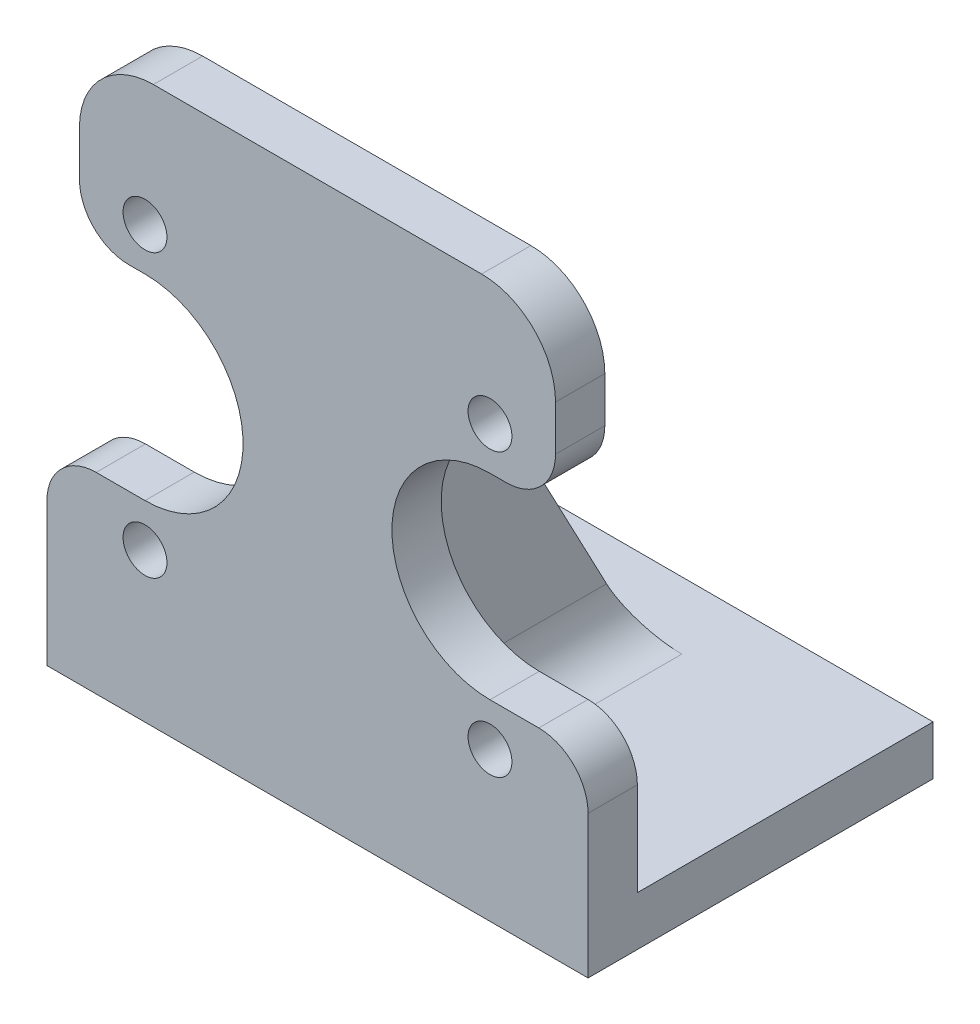
ISO-10303-21;
HEADER;
FILE_DESCRIPTION(('STEP AP214'),'2;1');
FILE_NAME('part.step','',(''),(''),'','','');
FILE_SCHEMA(('AUTOMOTIVE_DESIGN { 1 0 10303 214 1 1 1 1 }'));
ENDSEC;
DATA;
#1=APPLICATION_CONTEXT('core data for automotive mechanical design processes');
#2=APPLICATION_PROTOCOL_DEFINITION('international standard','automotive_design',2000,#1);
#3=PRODUCT_CONTEXT('',#1,'mechanical');
#4=PRODUCT('Part','Part','',(#3));
#5=PRODUCT_RELATED_PRODUCT_CATEGORY('part','',(#4));
#6=PRODUCT_DEFINITION_FORMATION('','',#4);
#7=PRODUCT_DEFINITION_CONTEXT('part definition',#1,'design');
#8=PRODUCT_DEFINITION('design','',#6,#7);
#9=PRODUCT_DEFINITION_SHAPE('','',#8);
#10=(LENGTH_UNIT() NAMED_UNIT(*) SI_UNIT(.MILLI.,.METRE.));
#11=(NAMED_UNIT(*) PLANE_ANGLE_UNIT() SI_UNIT($,.RADIAN.));
#12=(NAMED_UNIT(*) SI_UNIT($,.STERADIAN.) SOLID_ANGLE_UNIT());
#13=UNCERTAINTY_MEASURE_WITH_UNIT(LENGTH_MEASURE(1.E-05),#10,'distance_accuracy_value','');
#14=(GEOMETRIC_REPRESENTATION_CONTEXT(3) GLOBAL_UNCERTAINTY_ASSIGNED_CONTEXT((#13)) GLOBAL_UNIT_ASSIGNED_CONTEXT((#10,
#11,#12)) REPRESENTATION_CONTEXT('',''));
#15=CARTESIAN_POINT('',(0.,0.,0.));
#16=DIRECTION('',(0.,0.,1.));
#17=DIRECTION('',(1.,0.,0.));
#18=AXIS2_PLACEMENT_3D('',#15,#16,#17);
#19=CARTESIAN_POINT('',(47.5,20.,-10.));
#20=DIRECTION('',(0.,0.,-1.));
#21=DIRECTION('',(-1.,0.,0.));
#22=AXIS2_PLACEMENT_3D('',#19,#20,#21);
#23=CYLINDRICAL_SURFACE('',#22,10.);
#24=DIRECTION('',(0.,0.,-1.));
#25=VECTOR('',#24,1.);
#26=CARTESIAN_POINT('',(47.5,10.,-10.));
#27=LINE('',#26,#25);
#28=CARTESIAN_POINT('',(47.5,10.,-10.));
#29=VERTEX_POINT('',#28);
#30=CARTESIAN_POINT('',(47.5,10.,-56.4277157369135));
#31=VERTEX_POINT('',#30);
#32=EDGE_CURVE('E244',#29,#31,#27,.T.);
#33=ORIENTED_EDGE('',*,*,#32,.F.);
#34=CARTESIAN_POINT('',(47.5,20.,-10.));
#35=DIRECTION('',(0.,0.,1.));
#36=DIRECTION('',(1.,0.,0.));
#37=AXIS2_PLACEMENT_3D('',#34,#35,#36);
#38=CIRCLE('',#37,10.);
#39=CARTESIAN_POINT('',(57.5,20.,-10.));
#40=VERTEX_POINT('',#39);
#41=EDGE_CURVE('E39',#40,#29,#38,.F.);
#42=ORIENTED_EDGE('',*,*,#41,.F.);
#43=DIRECTION('',(0.,0.,-1.));
#44=VECTOR('',#43,1.);
#45=CARTESIAN_POINT('',(57.5,20.,0.));
#46=LINE('',#45,#44);
#47=CARTESIAN_POINT('',(57.5,20.,-51.1455211930621));
#48=VERTEX_POINT('',#47);
#49=EDGE_CURVE('E247',#48,#40,#46,.F.);
#50=ORIENTED_EDGE('',*,*,#49,.F.);
#51=CARTESIAN_POINT('',(47.5,20.,-51.1455211930621));
#52=DIRECTION('',(0.,-0.467064047912866,0.884223487104503));
#53=DIRECTION('',(0.,-0.884223487104504,-0.467064047912866));
#54=AXIS2_PLACEMENT_3D('',#51,#52,#53);
#55=ELLIPSE('',#54,11.3093580365595,10.);
#56=EDGE_CURVE('E11',#48,#31,#55,.F.);
#57=ORIENTED_EDGE('',*,*,#56,.T.);
#58=EDGE_LOOP('',(#33,#42,#50,#57));
#59=FACE_BOUND('',#58,.T.);
#60=ADVANCED_FACE('F32',(#59),#23,.F.);
#61=CARTESIAN_POINT('',(82.5,20.,-10.));
#62=DIRECTION('',(0.,0.,-1.));
#63=DIRECTION('',(-1.,0.,0.));
#64=AXIS2_PLACEMENT_3D('',#61,#62,#63);
#65=CYLINDRICAL_SURFACE('',#64,10.);
#66=DIRECTION('',(0.,0.,1.));
#67=VECTOR('',#66,1.);
#68=CARTESIAN_POINT('',(82.5,10.,-10.));
#69=LINE('',#68,#67);
#70=CARTESIAN_POINT('',(82.5,10.,-56.4277157369135));
#71=VERTEX_POINT('',#70);
#72=CARTESIAN_POINT('',(82.5,10.,-10.));
#73=VERTEX_POINT('',#72);
#74=EDGE_CURVE('E373',#71,#73,#69,.T.);
#75=ORIENTED_EDGE('',*,*,#74,.F.);
#76=CARTESIAN_POINT('',(82.5,20.,-51.1455211930621));
#77=DIRECTION('',(0.,-0.467064047912866,0.884223487104503));
#78=DIRECTION('',(0.,-0.884223487104504,-0.467064047912866));
#79=AXIS2_PLACEMENT_3D('',#76,#77,#78);
#80=ELLIPSE('',#79,11.3093580365595,10.);
#81=CARTESIAN_POINT('',(72.5,20.,-51.1455211930621));
#82=VERTEX_POINT('',#81);
#83=EDGE_CURVE('E242',#71,#82,#80,.F.);
#84=ORIENTED_EDGE('',*,*,#83,.T.);
#85=DIRECTION('',(0.,0.,1.));
#86=VECTOR('',#85,1.);
#87=CARTESIAN_POINT('',(72.5,20.,-10.));
#88=LINE('',#87,#86);
#89=CARTESIAN_POINT('',(72.5,20.,-10.));
#90=VERTEX_POINT('',#89);
#91=EDGE_CURVE('E469',#90,#82,#88,.F.);
#92=ORIENTED_EDGE('',*,*,#91,.F.);
#93=CARTESIAN_POINT('',(82.5,20.,-10.));
#94=DIRECTION('',(0.,0.,1.));
#95=DIRECTION('',(1.,0.,0.));
#96=AXIS2_PLACEMENT_3D('',#93,#94,#95);
#97=CIRCLE('',#96,10.);
#98=EDGE_CURVE('E472',#73,#90,#97,.F.);
#99=ORIENTED_EDGE('',*,*,#98,.F.);
#100=EDGE_LOOP('',(#75,#84,#92,#99));
#101=FACE_BOUND('',#100,.T.);
#102=ADVANCED_FACE('F477',(#101),#65,.F.);
#103=CARTESIAN_POINT('',(20.1,28.94,-10.));
#104=DIRECTION('',(0.,0.,1.));
#105=DIRECTION('',(1.,0.,0.));
#106=AXIS2_PLACEMENT_3D('',#103,#104,#105);
#107=CYLINDRICAL_SURFACE('',#106,9.99999999999999);
#108=CARTESIAN_POINT('',(20.1,28.94,0.));
#109=DIRECTION('',(0.,0.,1.));
#110=DIRECTION('',(1.,0.,0.));
#111=AXIS2_PLACEMENT_3D('',#108,#109,#110);
#112=CIRCLE('',#111,9.99999999999999);
#113=CARTESIAN_POINT('',(20.1,38.94,0.));
#114=VERTEX_POINT('',#113);
#115=CARTESIAN_POINT('',(10.1,28.94,0.));
#116=VERTEX_POINT('',#115);
#117=EDGE_CURVE('E320',#114,#116,#112,.T.);
#118=ORIENTED_EDGE('',*,*,#117,.F.);
#119=DIRECTION('',(0.,0.,1.));
#120=VECTOR('',#119,1.);
#121=CARTESIAN_POINT('',(20.1,38.94,-10.));
#122=LINE('',#121,#120);
#123=CARTESIAN_POINT('',(20.1,38.94,-10.));
#124=VERTEX_POINT('',#123);
#125=EDGE_CURVE('E371',#124,#114,#122,.T.);
#126=ORIENTED_EDGE('',*,*,#125,.F.);
#127=CARTESIAN_POINT('',(20.1,28.94,-10.));
#128=DIRECTION('',(0.,0.,1.));
#129=DIRECTION('',(1.,0.,0.));
#130=AXIS2_PLACEMENT_3D('',#127,#128,#129);
#131=CIRCLE('',#130,9.99999999999999);
#132=CARTESIAN_POINT('',(10.1,28.94,-10.));
#133=VERTEX_POINT('',#132);
#134=EDGE_CURVE('E267',#124,#133,#131,.T.);
#135=ORIENTED_EDGE('',*,*,#134,.T.);
#136=DIRECTION('',(0.,0.,1.));
#137=VECTOR('',#136,1.);
#138=CARTESIAN_POINT('',(10.1,28.94,-10.));
#139=LINE('',#138,#137);
#140=EDGE_CURVE('E263',#133,#116,#139,.T.);
#141=ORIENTED_EDGE('',*,*,#140,.T.);
#142=EDGE_LOOP('',(#118,#126,#135,#141));
#143=FACE_BOUND('',#142,.T.);
#144=ADVANCED_FACE('F403',(#143),#107,.T.);
#145=CARTESIAN_POINT('',(30.,38.94,-10.));
#146=DIRECTION('',(0.,1.,0.));
#147=DIRECTION('',(0.,0.,1.));
#148=AXIS2_PLACEMENT_3D('',#145,#146,#147);
#149=PLANE('',#148);
#150=DIRECTION('',(-1.,0.,0.));
#151=VECTOR('',#150,1.);
#152=CARTESIAN_POINT('',(30.,38.94,0.));
#153=LINE('',#152,#151);
#154=CARTESIAN_POINT('',(30.,38.94,0.));
#155=VERTEX_POINT('',#154);
#156=EDGE_CURVE('E270',#155,#114,#153,.T.);
#157=ORIENTED_EDGE('',*,*,#156,.F.);
#158=DIRECTION('',(0.,0.,1.));
#159=VECTOR('',#158,1.);
#160=CARTESIAN_POINT('',(30.,38.94,-10.));
#161=LINE('',#160,#159);
#162=CARTESIAN_POINT('',(30.,38.94,-10.));
#163=VERTEX_POINT('',#162);
#164=EDGE_CURVE('E374',#163,#155,#161,.T.);
#165=ORIENTED_EDGE('',*,*,#164,.F.);
#166=DIRECTION('',(-1.,0.,0.));
#167=VECTOR('',#166,1.);
#168=CARTESIAN_POINT('',(30.,38.94,-10.));
#169=LINE('',#168,#167);
#170=EDGE_CURVE('E317',#163,#124,#169,.T.);
#171=ORIENTED_EDGE('',*,*,#170,.T.);
#172=ORIENTED_EDGE('',*,*,#125,.T.);
#173=EDGE_LOOP('',(#157,#165,#171,#172));
#174=FACE_BOUND('',#173,.T.);
#175=ADVANCED_FACE('F409',(#174),#149,.T.);
#176=CARTESIAN_POINT('',(30.,58.84,-10.));
#177=DIRECTION('',(0.,0.,1.));
#178=DIRECTION('',(1.,0.,0.));
#179=AXIS2_PLACEMENT_3D('',#176,#177,#178);
#180=CYLINDRICAL_SURFACE('',#179,19.9);
#181=CARTESIAN_POINT('',(30.,58.84,0.));
#182=DIRECTION('',(0.,0.,-1.));
#183=DIRECTION('',(1.,0.,0.));
#184=AXIS2_PLACEMENT_3D('',#181,#182,#183);
#185=CIRCLE('',#184,19.9);
#186=CARTESIAN_POINT('',(30.,78.74,0.));
#187=VERTEX_POINT('',#186);
#188=EDGE_CURVE('E366',#187,#155,#185,.T.);
#189=ORIENTED_EDGE('',*,*,#188,.F.);
#190=DIRECTION('',(0.,0.,1.));
#191=VECTOR('',#190,1.);
#192=CARTESIAN_POINT('',(30.,78.74,-10.));
#193=LINE('',#192,#191);
#194=CARTESIAN_POINT('',(30.,78.74,-10.));
#195=VERTEX_POINT('',#194);
#196=EDGE_CURVE('E376',#195,#187,#193,.T.);
#197=ORIENTED_EDGE('',*,*,#196,.F.);
#198=CARTESIAN_POINT('',(30.,58.84,-10.));
#199=DIRECTION('',(0.,0.,-1.));
#200=DIRECTION('',(1.,0.,0.));
#201=AXIS2_PLACEMENT_3D('',#198,#199,#200);
#202=CIRCLE('',#201,19.9);
#203=EDGE_CURVE('E314',#195,#163,#202,.T.);
#204=ORIENTED_EDGE('',*,*,#203,.T.);
#205=ORIENTED_EDGE('',*,*,#164,.T.);
#206=EDGE_LOOP('',(#189,#197,#204,#205));
#207=FACE_BOUND('',#206,.T.);
#208=ADVANCED_FACE('F543',(#207),#180,.F.);
#209=CARTESIAN_POINT('',(26.7042467961392,78.74,-10.));
#210=DIRECTION('',(0.,-1.,0.));
#211=DIRECTION('',(0.,0.,-1.));
#212=AXIS2_PLACEMENT_3D('',#209,#210,#211);
#213=PLANE('',#212);
#214=DIRECTION('',(1.,0.,0.));
#215=VECTOR('',#214,1.);
#216=CARTESIAN_POINT('',(26.7042467961392,78.74,0.));
#217=LINE('',#216,#215);
#218=CARTESIAN_POINT('',(26.7042467961392,78.74,0.));
#219=VERTEX_POINT('',#218);
#220=EDGE_CURVE('E363',#219,#187,#217,.T.);
#221=ORIENTED_EDGE('',*,*,#220,.F.);
#222=DIRECTION('',(0.,0.,1.));
#223=VECTOR('',#222,1.);
#224=CARTESIAN_POINT('',(26.7042467961392,78.74,-10.));
#225=LINE('',#224,#223);
#226=CARTESIAN_POINT('',(26.7042467961392,78.74,-10.));
#227=VERTEX_POINT('',#226);
#228=EDGE_CURVE('E378',#227,#219,#225,.T.);
#229=ORIENTED_EDGE('',*,*,#228,.F.);
#230=DIRECTION('',(1.,0.,0.));
#231=VECTOR('',#230,1.);
#232=CARTESIAN_POINT('',(26.7042467961392,78.74,-10.));
#233=LINE('',#232,#231);
#234=EDGE_CURVE('E311',#227,#195,#233,.T.);
#235=ORIENTED_EDGE('',*,*,#234,.T.);
#236=ORIENTED_EDGE('',*,*,#196,.T.);
#237=EDGE_LOOP('',(#221,#229,#235,#236));
#238=FACE_BOUND('',#237,.T.);
#239=ADVANCED_FACE('F417',(#238),#213,.T.);
#240=CARTESIAN_POINT('',(26.7042467961392,88.74,-10.));
#241=DIRECTION('',(0.,0.,1.));
#242=DIRECTION('',(1.,0.,0.));
#243=AXIS2_PLACEMENT_3D('',#240,#241,#242);
#244=CYLINDRICAL_SURFACE('',#243,9.99999999999999);
#245=CARTESIAN_POINT('',(26.7042467961392,88.74,0.));
#246=DIRECTION('',(0.,0.,1.));
#247=DIRECTION('',(1.,0.,0.));
#248=AXIS2_PLACEMENT_3D('',#245,#246,#247);
#249=CIRCLE('',#248,9.99999999999999);
#250=CARTESIAN_POINT('',(16.7042467961392,88.74,0.));
#251=VERTEX_POINT('',#250);
#252=EDGE_CURVE('E360',#251,#219,#249,.T.);
#253=ORIENTED_EDGE('',*,*,#252,.F.);
#254=DIRECTION('',(0.,0.,1.));
#255=VECTOR('',#254,1.);
#256=CARTESIAN_POINT('',(16.7042467961392,88.74,-10.));
#257=LINE('',#256,#255);
#258=CARTESIAN_POINT('',(16.7042467961392,88.74,-10.));
#259=VERTEX_POINT('',#258);
#260=EDGE_CURVE('E380',#259,#251,#257,.T.);
#261=ORIENTED_EDGE('',*,*,#260,.F.);
#262=CARTESIAN_POINT('',(26.7042467961392,88.74,-10.));
#263=DIRECTION('',(0.,0.,1.));
#264=DIRECTION('',(1.,0.,0.));
#265=AXIS2_PLACEMENT_3D('',#262,#263,#264);
#266=CIRCLE('',#265,9.99999999999999);
#267=EDGE_CURVE('E308',#259,#227,#266,.T.);
#268=ORIENTED_EDGE('',*,*,#267,.T.);
#269=ORIENTED_EDGE('',*,*,#228,.T.);
#270=EDGE_LOOP('',(#253,#261,#268,#269));
#271=FACE_BOUND('',#270,.T.);
#272=ADVANCED_FACE('F420',(#271),#244,.T.);
#273=CARTESIAN_POINT('',(16.7042467961392,97.8947478202153,-10.));
#274=DIRECTION('',(-1.,0.,0.));
#275=DIRECTION('',(0.,0.,1.));
#276=AXIS2_PLACEMENT_3D('',#273,#274,#275);
#277=PLANE('',#276);
#278=DIRECTION('',(0.,-1.,0.));
#279=VECTOR('',#278,1.);
#280=CARTESIAN_POINT('',(16.7042467961392,97.8947478202153,0.));
#281=LINE('',#280,#279);
#282=CARTESIAN_POINT('',(16.7042467961392,97.8947478202153,0.));
#283=VERTEX_POINT('',#282);
#284=EDGE_CURVE('E357',#283,#251,#281,.T.);
#285=ORIENTED_EDGE('',*,*,#284,.F.);
#286=DIRECTION('',(0.,0.,1.));
#287=VECTOR('',#286,1.);
#288=CARTESIAN_POINT('',(16.7042467961392,97.8947478202153,-10.));
#289=LINE('',#288,#287);
#290=CARTESIAN_POINT('',(16.7042467961392,97.8947478202153,-10.));
#291=VERTEX_POINT('',#290);
#292=EDGE_CURVE('E382',#291,#283,#289,.T.);
#293=ORIENTED_EDGE('',*,*,#292,.F.);
#294=DIRECTION('',(0.,-1.,0.));
#295=VECTOR('',#294,1.);
#296=CARTESIAN_POINT('',(16.7042467961392,97.8947478202153,-10.));
#297=LINE('',#296,#295);
#298=EDGE_CURVE('E305',#291,#259,#297,.T.);
#299=ORIENTED_EDGE('',*,*,#298,.T.);
#300=ORIENTED_EDGE('',*,*,#260,.T.);
#301=EDGE_LOOP('',(#285,#293,#299,#300));
#302=FACE_BOUND('',#301,.T.);
#303=ADVANCED_FACE('F425',(#302),#277,.T.);
#304=CARTESIAN_POINT('',(31.7042467961392,97.8947478202153,-10.));
#305=DIRECTION('',(0.,0.,1.));
#306=DIRECTION('',(1.,0.,0.));
#307=AXIS2_PLACEMENT_3D('',#304,#305,#306);
#308=CYLINDRICAL_SURFACE('',#307,15.);
#309=CARTESIAN_POINT('',(31.7042467961392,97.8947478202153,0.));
#310=DIRECTION('',(0.,0.,1.));
#311=DIRECTION('',(1.,0.,0.));
#312=AXIS2_PLACEMENT_3D('',#309,#310,#311);
#313=CIRCLE('',#312,15.);
#314=CARTESIAN_POINT('',(31.7042467961392,112.894747820215,0.));
#315=VERTEX_POINT('',#314);
#316=EDGE_CURVE('E354',#315,#283,#313,.T.);
#317=ORIENTED_EDGE('',*,*,#316,.F.);
#318=DIRECTION('',(0.,0.,1.));
#319=VECTOR('',#318,1.);
#320=CARTESIAN_POINT('',(31.7042467961392,112.894747820215,-10.));
#321=LINE('',#320,#319);
#322=CARTESIAN_POINT('',(31.7042467961392,112.894747820215,-10.));
#323=VERTEX_POINT('',#322);
#324=EDGE_CURVE('E384',#323,#315,#321,.T.);
#325=ORIENTED_EDGE('',*,*,#324,.F.);
#326=CARTESIAN_POINT('',(31.7042467961392,97.8947478202153,-10.));
#327=DIRECTION('',(0.,0.,1.));
#328=DIRECTION('',(1.,0.,0.));
#329=AXIS2_PLACEMENT_3D('',#326,#327,#328);
#330=CIRCLE('',#329,15.);
#331=EDGE_CURVE('E302',#323,#291,#330,.T.);
#332=ORIENTED_EDGE('',*,*,#331,.T.);
#333=ORIENTED_EDGE('',*,*,#292,.T.);
#334=EDGE_LOOP('',(#317,#325,#332,#333));
#335=FACE_BOUND('',#334,.T.);
#336=ADVANCED_FACE('F428',(#335),#308,.T.);
#337=CARTESIAN_POINT('',(98.2957532038608,112.894747820215,-10.));
#338=DIRECTION('',(0.,1.,0.));
#339=DIRECTION('',(-1.,0.,0.));
#340=AXIS2_PLACEMENT_3D('',#337,#338,#339);
#341=PLANE('',#340);
#342=DIRECTION('',(-1.,0.,0.));
#343=VECTOR('',#342,1.);
#344=CARTESIAN_POINT('',(98.2957532038608,112.894747820215,0.));
#345=LINE('',#344,#343);
#346=CARTESIAN_POINT('',(98.2957532038608,112.894747820215,0.));
#347=VERTEX_POINT('',#346);
#348=EDGE_CURVE('E351',#347,#315,#345,.T.);
#349=ORIENTED_EDGE('',*,*,#348,.F.);
#350=DIRECTION('',(0.,0.,1.));
#351=VECTOR('',#350,1.);
#352=CARTESIAN_POINT('',(98.2957532038608,112.894747820215,-10.));
#353=LINE('',#352,#351);
#354=CARTESIAN_POINT('',(98.2957532038608,112.894747820215,-10.));
#355=VERTEX_POINT('',#354);
#356=EDGE_CURVE('E386',#355,#347,#353,.T.);
#357=ORIENTED_EDGE('',*,*,#356,.F.);
#358=DIRECTION('',(-1.,0.,0.));
#359=VECTOR('',#358,1.);
#360=CARTESIAN_POINT('',(98.2957532038608,112.894747820215,-10.));
#361=LINE('',#360,#359);
#362=EDGE_CURVE('E299',#355,#323,#361,.T.);
#363=ORIENTED_EDGE('',*,*,#362,.T.);
#364=ORIENTED_EDGE('',*,*,#324,.T.);
#365=EDGE_LOOP('',(#349,#357,#363,#364));
#366=FACE_BOUND('',#365,.T.);
#367=ADVANCED_FACE('F433',(#366),#341,.T.);
#368=CARTESIAN_POINT('',(98.2957532038608,97.8947478202153,-10.));
#369=DIRECTION('',(0.,0.,1.));
#370=DIRECTION('',(1.,0.,0.));
#371=AXIS2_PLACEMENT_3D('',#368,#369,#370);
#372=CYLINDRICAL_SURFACE('',#371,15.);
#373=CARTESIAN_POINT('',(98.2957532038608,97.8947478202153,0.));
#374=DIRECTION('',(0.,0.,1.));
#375=DIRECTION('',(-1.,0.,0.));
#376=AXIS2_PLACEMENT_3D('',#373,#374,#375);
#377=CIRCLE('',#376,15.);
#378=CARTESIAN_POINT('',(113.295753203861,97.8947478202153,0.));
#379=VERTEX_POINT('',#378);
#380=EDGE_CURVE('E348',#379,#347,#377,.T.);
#381=ORIENTED_EDGE('',*,*,#380,.F.);
#382=DIRECTION('',(0.,0.,1.));
#383=VECTOR('',#382,1.);
#384=CARTESIAN_POINT('',(113.295753203861,97.8947478202153,-10.));
#385=LINE('',#384,#383);
#386=CARTESIAN_POINT('',(113.295753203861,97.8947478202153,-10.));
#387=VERTEX_POINT('',#386);
#388=EDGE_CURVE('E388',#387,#379,#385,.T.);
#389=ORIENTED_EDGE('',*,*,#388,.F.);
#390=CARTESIAN_POINT('',(98.2957532038608,97.8947478202153,-10.));
#391=DIRECTION('',(0.,0.,1.));
#392=DIRECTION('',(-1.,0.,0.));
#393=AXIS2_PLACEMENT_3D('',#390,#391,#392);
#394=CIRCLE('',#393,15.);
#395=EDGE_CURVE('E296',#387,#355,#394,.T.);
#396=ORIENTED_EDGE('',*,*,#395,.T.);
#397=ORIENTED_EDGE('',*,*,#356,.T.);
#398=EDGE_LOOP('',(#381,#389,#396,#397));
#399=FACE_BOUND('',#398,.T.);
#400=ADVANCED_FACE('F436',(#399),#372,.T.);
#401=CARTESIAN_POINT('',(113.295753203861,97.8947478202153,-10.));
#402=DIRECTION('',(1.,0.,0.));
#403=DIRECTION('',(0.,0.,-1.));
#404=AXIS2_PLACEMENT_3D('',#401,#402,#403);
#405=PLANE('',#404);
#406=DIRECTION('',(0.,1.,0.));
#407=VECTOR('',#406,1.);
#408=CARTESIAN_POINT('',(113.295753203861,97.8947478202153,0.));
#409=LINE('',#408,#407);
#410=CARTESIAN_POINT('',(113.295753203861,88.74,0.));
#411=VERTEX_POINT('',#410);
#412=EDGE_CURVE('E345',#411,#379,#409,.T.);
#413=ORIENTED_EDGE('',*,*,#412,.F.);
#414=DIRECTION('',(0.,0.,1.));
#415=VECTOR('',#414,1.);
#416=CARTESIAN_POINT('',(113.295753203861,88.74,-10.));
#417=LINE('',#416,#415);
#418=CARTESIAN_POINT('',(113.295753203861,88.74,-10.));
#419=VERTEX_POINT('',#418);
#420=EDGE_CURVE('E390',#419,#411,#417,.T.);
#421=ORIENTED_EDGE('',*,*,#420,.F.);
#422=DIRECTION('',(0.,1.,0.));
#423=VECTOR('',#422,1.);
#424=CARTESIAN_POINT('',(113.295753203861,97.8947478202153,-10.));
#425=LINE('',#424,#423);
#426=EDGE_CURVE('E293',#419,#387,#425,.T.);
#427=ORIENTED_EDGE('',*,*,#426,.T.);
#428=ORIENTED_EDGE('',*,*,#388,.T.);
#429=EDGE_LOOP('',(#413,#421,#427,#428));
#430=FACE_BOUND('',#429,.T.);
#431=ADVANCED_FACE('F441',(#430),#405,.T.);
#432=CARTESIAN_POINT('',(103.295753203861,88.74,-10.));
#433=DIRECTION('',(0.,0.,1.));
#434=DIRECTION('',(1.,0.,0.));
#435=AXIS2_PLACEMENT_3D('',#432,#433,#434);
#436=CYLINDRICAL_SURFACE('',#435,10.);
#437=CARTESIAN_POINT('',(103.295753203861,88.74,0.));
#438=DIRECTION('',(0.,0.,1.));
#439=DIRECTION('',(-1.,0.,0.));
#440=AXIS2_PLACEMENT_3D('',#437,#438,#439);
#441=CIRCLE('',#440,10.);
#442=CARTESIAN_POINT('',(103.295753203861,78.74,0.));
#443=VERTEX_POINT('',#442);
#444=EDGE_CURVE('E342',#443,#411,#441,.T.);
#445=ORIENTED_EDGE('',*,*,#444,.F.);
#446=DIRECTION('',(0.,0.,1.));
#447=VECTOR('',#446,1.);
#448=CARTESIAN_POINT('',(103.295753203861,78.74,-10.));
#449=LINE('',#448,#447);
#450=CARTESIAN_POINT('',(103.295753203861,78.74,-10.));
#451=VERTEX_POINT('',#450);
#452=EDGE_CURVE('E392',#451,#443,#449,.T.);
#453=ORIENTED_EDGE('',*,*,#452,.F.);
#454=CARTESIAN_POINT('',(103.295753203861,88.74,-10.));
#455=DIRECTION('',(0.,0.,1.));
#456=DIRECTION('',(-1.,0.,0.));
#457=AXIS2_PLACEMENT_3D('',#454,#455,#456);
#458=CIRCLE('',#457,10.);
#459=EDGE_CURVE('E290',#451,#419,#458,.T.);
#460=ORIENTED_EDGE('',*,*,#459,.T.);
#461=ORIENTED_EDGE('',*,*,#420,.T.);
#462=EDGE_LOOP('',(#445,#453,#460,#461));
#463=FACE_BOUND('',#462,.T.);
#464=ADVANCED_FACE('F444',(#463),#436,.T.);
#465=CARTESIAN_POINT('',(103.295753203861,78.74,-10.));
#466=DIRECTION('',(0.,-1.,0.));
#467=DIRECTION('',(0.,0.,-1.));
#468=AXIS2_PLACEMENT_3D('',#465,#466,#467);
#469=PLANE('',#468);
#470=DIRECTION('',(1.,0.,0.));
#471=VECTOR('',#470,1.);
#472=CARTESIAN_POINT('',(103.295753203861,78.74,0.));
#473=LINE('',#472,#471);
#474=CARTESIAN_POINT('',(100.,78.74,0.));
#475=VERTEX_POINT('',#474);
#476=EDGE_CURVE('E339',#475,#443,#473,.T.);
#477=ORIENTED_EDGE('',*,*,#476,.F.);
#478=DIRECTION('',(0.,0.,1.));
#479=VECTOR('',#478,1.);
#480=CARTESIAN_POINT('',(100.,78.74,-10.));
#481=LINE('',#480,#479);
#482=CARTESIAN_POINT('',(100.,78.74,-10.));
#483=VERTEX_POINT('',#482);
#484=EDGE_CURVE('E394',#483,#475,#481,.T.);
#485=ORIENTED_EDGE('',*,*,#484,.F.);
#486=DIRECTION('',(1.,0.,0.));
#487=VECTOR('',#486,1.);
#488=CARTESIAN_POINT('',(103.295753203861,78.74,-10.));
#489=LINE('',#488,#487);
#490=EDGE_CURVE('E287',#483,#451,#489,.T.);
#491=ORIENTED_EDGE('',*,*,#490,.T.);
#492=ORIENTED_EDGE('',*,*,#452,.T.);
#493=EDGE_LOOP('',(#477,#485,#491,#492));
#494=FACE_BOUND('',#493,.T.);
#495=ADVANCED_FACE('F449',(#494),#469,.T.);
#496=CARTESIAN_POINT('',(100.,58.84,-10.));
#497=DIRECTION('',(0.,0.,1.));
#498=DIRECTION('',(1.,0.,0.));
#499=AXIS2_PLACEMENT_3D('',#496,#497,#498);
#500=CYLINDRICAL_SURFACE('',#499,19.9);
#501=CARTESIAN_POINT('',(100.,58.84,0.));
#502=DIRECTION('',(0.,0.,-1.));
#503=DIRECTION('',(-1.,0.,0.));
#504=AXIS2_PLACEMENT_3D('',#501,#502,#503);
#505=CIRCLE('',#504,19.9);
#506=CARTESIAN_POINT('',(100.,38.94,0.));
#507=VERTEX_POINT('',#506);
#508=EDGE_CURVE('E336',#507,#475,#505,.T.);
#509=ORIENTED_EDGE('',*,*,#508,.F.);
#510=DIRECTION('',(0.,0.,1.));
#511=VECTOR('',#510,1.);
#512=CARTESIAN_POINT('',(100.,38.94,-10.));
#513=LINE('',#512,#511);
#514=CARTESIAN_POINT('',(100.,38.94,-10.));
#515=VERTEX_POINT('',#514);
#516=EDGE_CURVE('E396',#515,#507,#513,.T.);
#517=ORIENTED_EDGE('',*,*,#516,.F.);
#518=CARTESIAN_POINT('',(100.,58.84,-10.));
#519=DIRECTION('',(0.,0.,-1.));
#520=DIRECTION('',(-1.,0.,0.));
#521=AXIS2_PLACEMENT_3D('',#518,#519,#520);
#522=CIRCLE('',#521,19.9);
#523=EDGE_CURVE('E284',#515,#483,#522,.T.);
#524=ORIENTED_EDGE('',*,*,#523,.T.);
#525=ORIENTED_EDGE('',*,*,#484,.T.);
#526=EDGE_LOOP('',(#509,#517,#524,#525));
#527=FACE_BOUND('',#526,.T.);
#528=ADVANCED_FACE('F452',(#527),#500,.F.);
#529=CARTESIAN_POINT('',(100.,38.94,-10.));
#530=DIRECTION('',(0.,1.,0.));
#531=DIRECTION('',(-1.,0.,0.));
#532=AXIS2_PLACEMENT_3D('',#529,#530,#531);
#533=PLANE('',#532);
#534=DIRECTION('',(-1.,0.,0.));
#535=VECTOR('',#534,1.);
#536=CARTESIAN_POINT('',(100.,38.94,0.));
#537=LINE('',#536,#535);
#538=CARTESIAN_POINT('',(109.9,38.94,0.));
#539=VERTEX_POINT('',#538);
#540=EDGE_CURVE('E333',#539,#507,#537,.T.);
#541=ORIENTED_EDGE('',*,*,#540,.F.);
#542=DIRECTION('',(0.,0.,1.));
#543=VECTOR('',#542,1.);
#544=CARTESIAN_POINT('',(109.9,38.94,-10.));
#545=LINE('',#544,#543);
#546=CARTESIAN_POINT('',(109.9,38.94,-10.));
#547=VERTEX_POINT('',#546);
#548=EDGE_CURVE('E398',#547,#539,#545,.T.);
#549=ORIENTED_EDGE('',*,*,#548,.F.);
#550=DIRECTION('',(-1.,0.,0.));
#551=VECTOR('',#550,1.);
#552=CARTESIAN_POINT('',(100.,38.94,-10.));
#553=LINE('',#552,#551);
#554=EDGE_CURVE('E281',#547,#515,#553,.T.);
#555=ORIENTED_EDGE('',*,*,#554,.T.);
#556=ORIENTED_EDGE('',*,*,#516,.T.);
#557=EDGE_LOOP('',(#541,#549,#555,#556));
#558=FACE_BOUND('',#557,.T.);
#559=ADVANCED_FACE('F457',(#558),#533,.T.);
#560=CARTESIAN_POINT('',(109.9,28.94,-10.));
#561=DIRECTION('',(0.,0.,1.));
#562=DIRECTION('',(1.,0.,0.));
#563=AXIS2_PLACEMENT_3D('',#560,#561,#562);
#564=CYLINDRICAL_SURFACE('',#563,10.);
#565=CARTESIAN_POINT('',(109.9,28.94,0.));
#566=DIRECTION('',(0.,0.,1.));
#567=DIRECTION('',(-1.,0.,0.));
#568=AXIS2_PLACEMENT_3D('',#565,#566,#567);
#569=CIRCLE('',#568,10.);
#570=CARTESIAN_POINT('',(119.9,28.94,0.));
#571=VERTEX_POINT('',#570);
#572=EDGE_CURVE('E330',#571,#539,#569,.T.);
#573=ORIENTED_EDGE('',*,*,#572,.F.);
#574=DIRECTION('',(0.,0.,1.));
#575=VECTOR('',#574,1.);
#576=CARTESIAN_POINT('',(119.9,28.94,-10.));
#577=LINE('',#576,#575);
#578=CARTESIAN_POINT('',(119.9,28.94,-10.));
#579=VERTEX_POINT('',#578);
#580=EDGE_CURVE('E205',#579,#571,#577,.T.);
#581=ORIENTED_EDGE('',*,*,#580,.F.);
#582=CARTESIAN_POINT('',(109.9,28.94,-10.));
#583=DIRECTION('',(0.,0.,1.));
#584=DIRECTION('',(-1.,0.,0.));
#585=AXIS2_PLACEMENT_3D('',#582,#583,#584);
#586=CIRCLE('',#585,10.);
#587=EDGE_CURVE('E268',#579,#547,#586,.T.);
#588=ORIENTED_EDGE('',*,*,#587,.T.);
#589=ORIENTED_EDGE('',*,*,#548,.T.);
#590=EDGE_LOOP('',(#573,#581,#588,#589));
#591=FACE_BOUND('',#590,.T.);
#592=ADVANCED_FACE('F460',(#591),#564,.T.);
#593=CARTESIAN_POINT('',(119.9,28.94,-10.));
#594=DIRECTION('',(1.,0.,0.));
#595=DIRECTION('',(0.,1.,0.));
#596=AXIS2_PLACEMENT_3D('',#593,#594,#595);
#597=PLANE('',#596);
#598=DIRECTION('',(0.,1.,0.));
#599=VECTOR('',#598,1.);
#600=CARTESIAN_POINT('',(119.9,28.94,0.));
#601=LINE('',#600,#599);
#602=CARTESIAN_POINT('',(119.9,0.,0.));
#603=VERTEX_POINT('',#602);
#604=EDGE_CURVE('E202',#603,#571,#601,.T.);
#605=ORIENTED_EDGE('',*,*,#604,.F.);
#606=DIRECTION('',(0.,0.,1.));
#607=VECTOR('',#606,1.);
#608=CARTESIAN_POINT('',(119.9,0.,-10.));
#609=LINE('',#608,#607);
#610=CARTESIAN_POINT('',(119.9,0.,-70.));
#611=VERTEX_POINT('',#610);
#612=EDGE_CURVE('E195',#611,#603,#609,.T.);
#613=ORIENTED_EDGE('',*,*,#612,.F.);
#614=DIRECTION('',(0.,1.,0.));
#615=VECTOR('',#614,1.);
#616=CARTESIAN_POINT('',(119.9,0.,-70.));
#617=LINE('',#616,#615);
#618=CARTESIAN_POINT('',(119.9,10.,-70.));
#619=VERTEX_POINT('',#618);
#620=EDGE_CURVE('E199',#611,#619,#617,.T.);
#621=ORIENTED_EDGE('',*,*,#620,.T.);
#622=DIRECTION('',(0.,0.,1.));
#623=VECTOR('',#622,1.);
#624=CARTESIAN_POINT('',(119.9,10.,-10.));
#625=LINE('',#624,#623);
#626=CARTESIAN_POINT('',(119.9,10.,-10.));
#627=VERTEX_POINT('',#626);
#628=EDGE_CURVE('E220',#619,#627,#625,.T.);
#629=ORIENTED_EDGE('',*,*,#628,.T.);
#630=DIRECTION('',(0.,1.,0.));
#631=VECTOR('',#630,1.);
#632=CARTESIAN_POINT('',(119.9,28.94,-10.));
#633=LINE('',#632,#631);
#634=EDGE_CURVE('E266',#627,#579,#633,.T.);
#635=ORIENTED_EDGE('',*,*,#634,.T.);
#636=ORIENTED_EDGE('',*,*,#580,.T.);
#637=EDGE_LOOP('',(#605,#613,#621,#629,#635,#636));
#638=FACE_BOUND('',#637,.T.);
#639=ADVANCED_FACE('F197',(#638),#597,.T.);
#640=CARTESIAN_POINT('',(62.0299521746018,0.,-10.));
#641=DIRECTION('',(0.,-1.,0.));
#642=DIRECTION('',(1.,0.,0.));
#643=AXIS2_PLACEMENT_3D('',#640,#641,#642);
#644=PLANE('',#643);
#645=DIRECTION('',(1.,0.,0.));
#646=VECTOR('',#645,1.);
#647=CARTESIAN_POINT('',(62.0299521746018,0.,0.));
#648=LINE('',#647,#646);
#649=CARTESIAN_POINT('',(10.1,0.,0.));
#650=VERTEX_POINT('',#649);
#651=EDGE_CURVE('E327',#650,#603,#648,.T.);
#652=ORIENTED_EDGE('',*,*,#651,.F.);
#653=DIRECTION('',(0.,0.,1.));
#654=VECTOR('',#653,1.);
#655=CARTESIAN_POINT('',(10.1,0.,-10.));
#656=LINE('',#655,#654);
#657=CARTESIAN_POINT('',(10.1,0.,-70.));
#658=VERTEX_POINT('',#657);
#659=EDGE_CURVE('E206',#658,#650,#656,.T.);
#660=ORIENTED_EDGE('',*,*,#659,.F.);
#661=DIRECTION('',(-1.,0.,0.));
#662=VECTOR('',#661,1.);
#663=CARTESIAN_POINT('',(119.9,0.,-70.));
#664=LINE('',#663,#662);
#665=EDGE_CURVE('E209',#611,#658,#664,.T.);
#666=ORIENTED_EDGE('',*,*,#665,.F.);
#667=ORIENTED_EDGE('',*,*,#612,.T.);
#668=EDGE_LOOP('',(#652,#660,#666,#667));
#669=FACE_BOUND('',#668,.T.);
#670=ADVANCED_FACE('F210',(#669),#644,.T.);
#671=CARTESIAN_POINT('',(10.1,28.94,-10.));
#672=DIRECTION('',(-1.,0.,0.));
#673=DIRECTION('',(0.,-1.,0.));
#674=AXIS2_PLACEMENT_3D('',#671,#672,#673);
#675=PLANE('',#674);
#676=DIRECTION('',(0.,-1.,0.));
#677=VECTOR('',#676,1.);
#678=CARTESIAN_POINT('',(10.1,28.94,0.));
#679=LINE('',#678,#677);
#680=EDGE_CURVE('E323',#116,#650,#679,.T.);
#681=ORIENTED_EDGE('',*,*,#680,.F.);
#682=ORIENTED_EDGE('',*,*,#140,.F.);
#683=DIRECTION('',(0.,-1.,0.));
#684=VECTOR('',#683,1.);
#685=CARTESIAN_POINT('',(10.1,28.94,-10.));
#686=LINE('',#685,#684);
#687=CARTESIAN_POINT('',(10.1,10.,-10.));
#688=VERTEX_POINT('',#687);
#689=EDGE_CURVE('E260',#133,#688,#686,.T.);
#690=ORIENTED_EDGE('',*,*,#689,.T.);
#691=DIRECTION('',(0.,0.,1.));
#692=VECTOR('',#691,1.);
#693=CARTESIAN_POINT('',(10.1,10.,-10.));
#694=LINE('',#693,#692);
#695=CARTESIAN_POINT('',(10.1,10.,-70.));
#696=VERTEX_POINT('',#695);
#697=EDGE_CURVE('E221',#696,#688,#694,.T.);
#698=ORIENTED_EDGE('',*,*,#697,.F.);
#699=DIRECTION('',(0.,1.,0.));
#700=VECTOR('',#699,1.);
#701=CARTESIAN_POINT('',(10.1,0.,-70.));
#702=LINE('',#701,#700);
#703=EDGE_CURVE('E226',#658,#696,#702,.T.);
#704=ORIENTED_EDGE('',*,*,#703,.F.);
#705=ORIENTED_EDGE('',*,*,#659,.T.);
#706=EDGE_LOOP('',(#681,#682,#690,#698,#704,#705));
#707=FACE_BOUND('',#706,.T.);
#708=ADVANCED_FACE('F262',(#707),#675,.T.);
#709=CARTESIAN_POINT('',(20.1,28.94,-10.));
#710=DIRECTION('',(0.,0.,1.));
#711=DIRECTION('',(1.,0.,0.));
#712=AXIS2_PLACEMENT_3D('',#709,#710,#711);
#713=PLANE('',#712);
#714=CARTESIAN_POINT('',(100.,87.44,-10.));
#715=DIRECTION('',(0.,0.,1.));
#716=DIRECTION('',(-1.,0.,0.));
#717=AXIS2_PLACEMENT_3D('',#714,#715,#716);
#718=CIRCLE('',#717,4.44999999999999);
#719=CARTESIAN_POINT('',(95.55,87.44,-10.));
#720=VERTEX_POINT('',#719);
#721=EDGE_CURVE('E768',#720,#720,#718,.T.);
#722=ORIENTED_EDGE('',*,*,#721,.T.);
#723=EDGE_LOOP('',(#722));
#724=FACE_BOUND('',#723,.T.);
#725=CARTESIAN_POINT('',(100.,30.24,-10.));
#726=DIRECTION('',(0.,0.,1.));
#727=DIRECTION('',(-1.,0.,0.));
#728=AXIS2_PLACEMENT_3D('',#725,#726,#727);
#729=CIRCLE('',#728,4.44999999999999);
#730=CARTESIAN_POINT('',(95.55,30.24,-10.));
#731=VERTEX_POINT('',#730);
#732=EDGE_CURVE('E775',#731,#731,#729,.T.);
#733=ORIENTED_EDGE('',*,*,#732,.T.);
#734=EDGE_LOOP('',(#733));
#735=FACE_BOUND('',#734,.T.);
#736=CARTESIAN_POINT('',(30.,87.44,-10.));
#737=DIRECTION('',(0.,0.,1.));
#738=DIRECTION('',(1.,0.,0.));
#739=AXIS2_PLACEMENT_3D('',#736,#737,#738);
#740=CIRCLE('',#739,4.44999999999999);
#741=CARTESIAN_POINT('',(34.45,87.44,-10.));
#742=VERTEX_POINT('',#741);
#743=EDGE_CURVE('E781',#742,#742,#740,.T.);
#744=ORIENTED_EDGE('',*,*,#743,.T.);
#745=EDGE_LOOP('',(#744));
#746=FACE_BOUND('',#745,.T.);
#747=CARTESIAN_POINT('',(30.,30.24,-10.));
#748=DIRECTION('',(0.,0.,1.));
#749=DIRECTION('',(1.,0.,0.));
#750=AXIS2_PLACEMENT_3D('',#747,#748,#749);
#751=CIRCLE('',#750,4.45);
#752=CARTESIAN_POINT('',(34.45,30.24,-10.));
#753=VERTEX_POINT('',#752);
#754=EDGE_CURVE('E324',#753,#753,#751,.T.);
#755=ORIENTED_EDGE('',*,*,#754,.T.);
#756=EDGE_LOOP('',(#755));
#757=FACE_BOUND('',#756,.T.);
#758=DIRECTION('',(0.,1.,0.));
#759=VECTOR('',#758,1.);
#760=CARTESIAN_POINT('',(57.5,97.8947478202153,-10.));
#761=LINE('',#760,#759);
#762=CARTESIAN_POINT('',(57.5,97.8947478202153,-10.));
#763=VERTEX_POINT('',#762);
#764=EDGE_CURVE('E254',#40,#763,#761,.T.);
#765=ORIENTED_EDGE('',*,*,#764,.F.);
#766=ORIENTED_EDGE('',*,*,#41,.T.);
#767=DIRECTION('',(-1.,0.,0.));
#768=VECTOR('',#767,1.);
#769=CARTESIAN_POINT('',(119.9,10.,-10.));
#770=LINE('',#769,#768);
#771=EDGE_CURVE('E223',#29,#688,#770,.T.);
#772=ORIENTED_EDGE('',*,*,#771,.T.);
#773=ORIENTED_EDGE('',*,*,#689,.F.);
#774=ORIENTED_EDGE('',*,*,#134,.F.);
#775=ORIENTED_EDGE('',*,*,#170,.F.);
#776=ORIENTED_EDGE('',*,*,#203,.F.);
#777=ORIENTED_EDGE('',*,*,#234,.F.);
#778=ORIENTED_EDGE('',*,*,#267,.F.);
#779=ORIENTED_EDGE('',*,*,#298,.F.);
#780=ORIENTED_EDGE('',*,*,#331,.F.);
#781=ORIENTED_EDGE('',*,*,#362,.F.);
#782=ORIENTED_EDGE('',*,*,#395,.F.);
#783=ORIENTED_EDGE('',*,*,#426,.F.);
#784=ORIENTED_EDGE('',*,*,#459,.F.);
#785=ORIENTED_EDGE('',*,*,#490,.F.);
#786=ORIENTED_EDGE('',*,*,#523,.F.);
#787=ORIENTED_EDGE('',*,*,#554,.F.);
#788=ORIENTED_EDGE('',*,*,#587,.F.);
#789=ORIENTED_EDGE('',*,*,#634,.F.);
#790=EDGE_CURVE('E237',#627,#73,#770,.T.);
#791=ORIENTED_EDGE('',*,*,#790,.T.);
#792=ORIENTED_EDGE('',*,*,#98,.T.);
#793=DIRECTION('',(0.,1.,0.));
#794=VECTOR('',#793,1.);
#795=CARTESIAN_POINT('',(72.5,97.8947478202153,-10.));
#796=LINE('',#795,#794);
#797=CARTESIAN_POINT('',(72.5,97.8947478202153,-10.));
#798=VERTEX_POINT('',#797);
#799=EDGE_CURVE('E484',#90,#798,#796,.T.);
#800=ORIENTED_EDGE('',*,*,#799,.T.);
#801=DIRECTION('',(1.,0.,0.));
#802=VECTOR('',#801,1.);
#803=CARTESIAN_POINT('',(57.5,97.8947478202153,-10.));
#804=LINE('',#803,#802);
#805=EDGE_CURVE('E487',#763,#798,#804,.T.);
#806=ORIENTED_EDGE('',*,*,#805,.F.);
#807=EDGE_LOOP('',(#765,#766,#772,#773,#774,#775,#776,#777,#778,#779,#780,#781,#782,#783,#784,
#785,#786,#787,#788,#789,#791,#792,#800,#806));
#808=FACE_BOUND('',#807,.T.);
#809=ADVANCED_FACE('F250',(#724,#735,#746,#757,#808),#713,.F.);
#810=CARTESIAN_POINT('',(20.1,28.94,0.));
#811=DIRECTION('',(0.,0.,1.));
#812=DIRECTION('',(1.,0.,0.));
#813=AXIS2_PLACEMENT_3D('',#810,#811,#812);
#814=PLANE('',#813);
#815=CARTESIAN_POINT('',(100.,87.44,0.));
#816=DIRECTION('',(0.,0.,1.));
#817=DIRECTION('',(-1.,0.,0.));
#818=AXIS2_PLACEMENT_3D('',#815,#816,#817);
#819=CIRCLE('',#818,4.44999999999999);
#820=CARTESIAN_POINT('',(95.55,87.44,0.));
#821=VERTEX_POINT('',#820);
#822=EDGE_CURVE('E214',#821,#821,#819,.T.);
#823=ORIENTED_EDGE('',*,*,#822,.F.);
#824=EDGE_LOOP('',(#823));
#825=FACE_BOUND('',#824,.T.);
#826=CARTESIAN_POINT('',(100.,30.24,0.));
#827=DIRECTION('',(0.,0.,1.));
#828=DIRECTION('',(-1.,0.,0.));
#829=AXIS2_PLACEMENT_3D('',#826,#827,#828);
#830=CIRCLE('',#829,4.44999999999999);
#831=CARTESIAN_POINT('',(95.55,30.24,0.));
#832=VERTEX_POINT('',#831);
#833=EDGE_CURVE('E772',#832,#832,#830,.T.);
#834=ORIENTED_EDGE('',*,*,#833,.F.);
#835=EDGE_LOOP('',(#834));
#836=FACE_BOUND('',#835,.T.);
#837=CARTESIAN_POINT('',(30.,87.44,0.));
#838=DIRECTION('',(0.,0.,1.));
#839=DIRECTION('',(1.,0.,0.));
#840=AXIS2_PLACEMENT_3D('',#837,#838,#839);
#841=CIRCLE('',#840,4.44999999999999);
#842=CARTESIAN_POINT('',(34.45,87.44,0.));
#843=VERTEX_POINT('',#842);
#844=EDGE_CURVE('E778',#843,#843,#841,.T.);
#845=ORIENTED_EDGE('',*,*,#844,.F.);
#846=EDGE_LOOP('',(#845));
#847=FACE_BOUND('',#846,.T.);
#848=CARTESIAN_POINT('',(30.,30.24,0.));
#849=DIRECTION('',(0.,0.,1.));
#850=DIRECTION('',(1.,0.,0.));
#851=AXIS2_PLACEMENT_3D('',#848,#849,#850);
#852=CIRCLE('',#851,4.45);
#853=CARTESIAN_POINT('',(34.45,30.24,0.));
#854=VERTEX_POINT('',#853);
#855=EDGE_CURVE('E784',#854,#854,#852,.T.);
#856=ORIENTED_EDGE('',*,*,#855,.F.);
#857=EDGE_LOOP('',(#856));
#858=FACE_BOUND('',#857,.T.);
#859=ORIENTED_EDGE('',*,*,#117,.T.);
#860=ORIENTED_EDGE('',*,*,#680,.T.);
#861=ORIENTED_EDGE('',*,*,#651,.T.);
#862=ORIENTED_EDGE('',*,*,#604,.T.);
#863=ORIENTED_EDGE('',*,*,#572,.T.);
#864=ORIENTED_EDGE('',*,*,#540,.T.);
#865=ORIENTED_EDGE('',*,*,#508,.T.);
#866=ORIENTED_EDGE('',*,*,#476,.T.);
#867=ORIENTED_EDGE('',*,*,#444,.T.);
#868=ORIENTED_EDGE('',*,*,#412,.T.);
#869=ORIENTED_EDGE('',*,*,#380,.T.);
#870=ORIENTED_EDGE('',*,*,#348,.T.);
#871=ORIENTED_EDGE('',*,*,#316,.T.);
#872=ORIENTED_EDGE('',*,*,#284,.T.);
#873=ORIENTED_EDGE('',*,*,#252,.T.);
#874=ORIENTED_EDGE('',*,*,#220,.T.);
#875=ORIENTED_EDGE('',*,*,#188,.T.);
#876=ORIENTED_EDGE('',*,*,#156,.T.);
#877=EDGE_LOOP('',(#859,#860,#861,#862,#863,#864,#865,#866,#867,#868,#869,#870,#871,#872,#873,
#874,#875,#876));
#878=FACE_BOUND('',#877,.T.);
#879=ADVANCED_FACE('F405',(#825,#836,#847,#858,#878),#814,.T.);
#880=CARTESIAN_POINT('',(30.,30.24,-10.));
#881=DIRECTION('',(0.,0.,1.));
#882=DIRECTION('',(1.,0.,0.));
#883=AXIS2_PLACEMENT_3D('',#880,#881,#882);
#884=CYLINDRICAL_SURFACE('',#883,4.45);
#885=ORIENTED_EDGE('',*,*,#754,.F.);
#886=EDGE_LOOP('',(#885));
#887=FACE_BOUND('',#886,.T.);
#888=ORIENTED_EDGE('',*,*,#855,.T.);
#889=EDGE_LOOP('',(#888));
#890=FACE_BOUND('',#889,.T.);
#891=ADVANCED_FACE('F550',(#887,#890),#884,.F.);
#892=CARTESIAN_POINT('',(30.,87.44,-10.));
#893=DIRECTION('',(0.,0.,1.));
#894=DIRECTION('',(1.,0.,0.));
#895=AXIS2_PLACEMENT_3D('',#892,#893,#894);
#896=CYLINDRICAL_SURFACE('',#895,4.44999999999999);
#897=ORIENTED_EDGE('',*,*,#743,.F.);
#898=EDGE_LOOP('',(#897));
#899=FACE_BOUND('',#898,.T.);
#900=ORIENTED_EDGE('',*,*,#844,.T.);
#901=EDGE_LOOP('',(#900));
#902=FACE_BOUND('',#901,.T.);
#903=ADVANCED_FACE('F557',(#899,#902),#896,.F.);
#904=CARTESIAN_POINT('',(100.,30.24,-10.));
#905=DIRECTION('',(0.,0.,1.));
#906=DIRECTION('',(1.,0.,0.));
#907=AXIS2_PLACEMENT_3D('',#904,#905,#906);
#908=CYLINDRICAL_SURFACE('',#907,4.44999999999999);
#909=ORIENTED_EDGE('',*,*,#732,.F.);
#910=EDGE_LOOP('',(#909));
#911=FACE_BOUND('',#910,.T.);
#912=ORIENTED_EDGE('',*,*,#833,.T.);
#913=EDGE_LOOP('',(#912));
#914=FACE_BOUND('',#913,.T.);
#915=ADVANCED_FACE('F561',(#911,#914),#908,.F.);
#916=CARTESIAN_POINT('',(100.,87.44,-10.));
#917=DIRECTION('',(0.,0.,1.));
#918=DIRECTION('',(1.,0.,0.));
#919=AXIS2_PLACEMENT_3D('',#916,#917,#918);
#920=CYLINDRICAL_SURFACE('',#919,4.44999999999999);
#921=ORIENTED_EDGE('',*,*,#721,.F.);
#922=EDGE_LOOP('',(#921));
#923=FACE_BOUND('',#922,.T.);
#924=ORIENTED_EDGE('',*,*,#822,.T.);
#925=EDGE_LOOP('',(#924));
#926=FACE_BOUND('',#925,.T.);
#927=ADVANCED_FACE('F565',(#923,#926),#920,.F.);
#928=CARTESIAN_POINT('',(119.9,0.,-70.));
#929=DIRECTION('',(0.,0.,1.));
#930=DIRECTION('',(1.,0.,0.));
#931=AXIS2_PLACEMENT_3D('',#928,#929,#930);
#932=PLANE('',#931);
#933=ORIENTED_EDGE('',*,*,#703,.T.);
#934=DIRECTION('',(-1.,0.,0.));
#935=VECTOR('',#934,1.);
#936=CARTESIAN_POINT('',(119.9,10.,-70.));
#937=LINE('',#936,#935);
#938=EDGE_CURVE('E215',#619,#696,#937,.T.);
#939=ORIENTED_EDGE('',*,*,#938,.F.);
#940=ORIENTED_EDGE('',*,*,#620,.F.);
#941=ORIENTED_EDGE('',*,*,#665,.T.);
#942=EDGE_LOOP('',(#933,#939,#940,#941));
#943=FACE_BOUND('',#942,.T.);
#944=ADVANCED_FACE('F217',(#943),#932,.F.);
#945=CARTESIAN_POINT('',(119.9,10.,-10.));
#946=DIRECTION('',(0.,-1.,0.));
#947=DIRECTION('',(0.,0.,-1.));
#948=AXIS2_PLACEMENT_3D('',#945,#946,#947);
#949=PLANE('',#948);
#950=ORIENTED_EDGE('',*,*,#771,.F.);
#951=ORIENTED_EDGE('',*,*,#32,.T.);
#952=DIRECTION('',(1.,0.,0.));
#953=VECTOR('',#952,1.);
#954=CARTESIAN_POINT('',(57.5,10.,-56.4277157369135));
#955=LINE('',#954,#953);
#956=EDGE_CURVE('E230',#31,#71,#955,.T.);
#957=ORIENTED_EDGE('',*,*,#956,.T.);
#958=ORIENTED_EDGE('',*,*,#74,.T.);
#959=ORIENTED_EDGE('',*,*,#790,.F.);
#960=ORIENTED_EDGE('',*,*,#628,.F.);
#961=ORIENTED_EDGE('',*,*,#938,.T.);
#962=ORIENTED_EDGE('',*,*,#697,.T.);
#963=EDGE_LOOP('',(#950,#951,#957,#958,#959,#960,#961,#962));
#964=FACE_BOUND('',#963,.T.);
#965=ADVANCED_FACE('F256',(#964),#949,.F.);
#966=CARTESIAN_POINT('',(57.5,10.,-56.4277157369135));
#967=DIRECTION('',(0.,-0.467064047912866,0.884223487104503));
#968=DIRECTION('',(0.,-0.884223487104504,-0.467064047912866));
#969=AXIS2_PLACEMENT_3D('',#966,#967,#968);
#970=PLANE('',#969);
#971=DIRECTION('',(0.,-0.884223487104504,-0.467064047912866));
#972=VECTOR('',#971,1.);
#973=CARTESIAN_POINT('',(72.5,10.,-56.4277157369135));
#974=LINE('',#973,#972);
#975=EDGE_CURVE('E483',#798,#82,#974,.T.);
#976=ORIENTED_EDGE('',*,*,#975,.T.);
#977=ORIENTED_EDGE('',*,*,#83,.F.);
#978=ORIENTED_EDGE('',*,*,#956,.F.);
#979=ORIENTED_EDGE('',*,*,#56,.F.);
#980=DIRECTION('',(0.,-0.884223487104504,-0.467064047912866));
#981=VECTOR('',#980,1.);
#982=CARTESIAN_POINT('',(57.5,10.,-56.4277157369135));
#983=LINE('',#982,#981);
#984=EDGE_CURVE('E489',#763,#48,#983,.T.);
#985=ORIENTED_EDGE('',*,*,#984,.F.);
#986=ORIENTED_EDGE('',*,*,#805,.T.);
#987=EDGE_LOOP('',(#976,#977,#978,#979,#985,#986));
#988=FACE_BOUND('',#987,.T.);
#989=ADVANCED_FACE('F486',(#988),#970,.F.);
#990=CARTESIAN_POINT('',(57.5,0.,0.));
#991=DIRECTION('',(-1.,0.,0.));
#992=DIRECTION('',(0.,-1.,0.));
#993=AXIS2_PLACEMENT_3D('',#990,#991,#992);
#994=PLANE('',#993);
#995=ORIENTED_EDGE('',*,*,#984,.T.);
#996=ORIENTED_EDGE('',*,*,#49,.T.);
#997=ORIENTED_EDGE('',*,*,#764,.T.);
#998=EDGE_LOOP('',(#995,#996,#997));
#999=FACE_BOUND('',#998,.T.);
#1000=ADVANCED_FACE('F495',(#999),#994,.T.);
#1001=CARTESIAN_POINT('',(72.5,0.,0.));
#1002=DIRECTION('',(-1.,0.,0.));
#1003=DIRECTION('',(0.,-1.,0.));
#1004=AXIS2_PLACEMENT_3D('',#1001,#1002,#1003);
#1005=PLANE('',#1004);
#1006=ORIENTED_EDGE('',*,*,#799,.F.);
#1007=ORIENTED_EDGE('',*,*,#91,.T.);
#1008=ORIENTED_EDGE('',*,*,#975,.F.);
#1009=EDGE_LOOP('',(#1006,#1007,#1008));
#1010=FACE_BOUND('',#1009,.T.);
#1011=ADVANCED_FACE('F482',(#1010),#1005,.F.);
#1012=CLOSED_SHELL('',(#60,#102,#144,#175,#208,#239,#272,#303,#336,#367,#400,#431,#464,#495,
#528,#559,#592,#639,#670,#708,#809,#879,#891,#903,#915,#927,#944,#965,#989,#1000,#1011));
#1013=MANIFOLD_SOLID_BREP('B2',#1012);
#1014=ADVANCED_BREP_SHAPE_REPRESENTATION('',(#18,#1013),#14);
#1015=SHAPE_DEFINITION_REPRESENTATION(#9,#1014);
ENDSEC;
END-ISO-10303-21;
